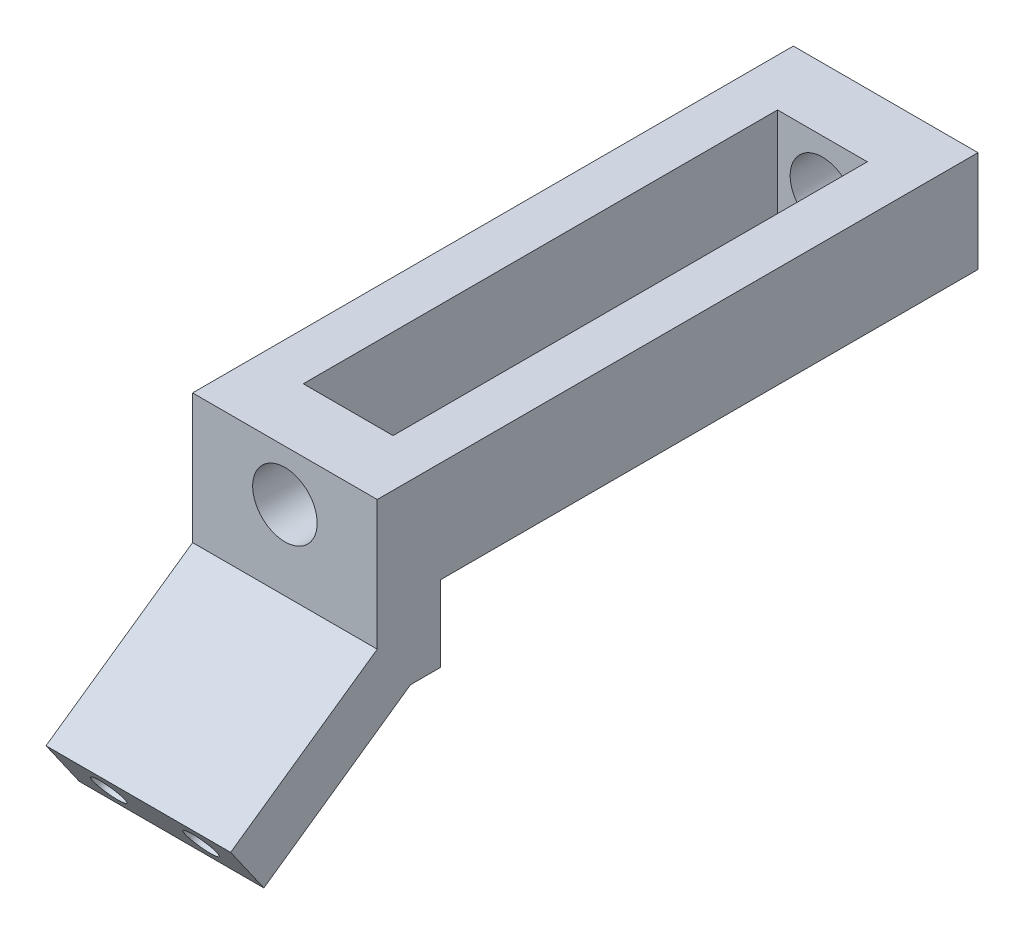
ISO-10303-21;
HEADER;
FILE_DESCRIPTION(('STEP AP214'),'2;1');
FILE_NAME('part.step','',(''),(''),'','','');
FILE_SCHEMA(('AUTOMOTIVE_DESIGN { 1 0 10303 214 1 1 1 1 }'));
ENDSEC;
DATA;
#1=APPLICATION_CONTEXT('core data for automotive mechanical design processes');
#2=APPLICATION_PROTOCOL_DEFINITION('international standard','automotive_design',2000,#1);
#3=PRODUCT_CONTEXT('',#1,'mechanical');
#4=PRODUCT('Part','Part','',(#3));
#5=PRODUCT_RELATED_PRODUCT_CATEGORY('part','',(#4));
#6=PRODUCT_DEFINITION_FORMATION('','',#4);
#7=PRODUCT_DEFINITION_CONTEXT('part definition',#1,'design');
#8=PRODUCT_DEFINITION('design','',#6,#7);
#9=PRODUCT_DEFINITION_SHAPE('','',#8);
#10=(LENGTH_UNIT() NAMED_UNIT(*) SI_UNIT(.MILLI.,.METRE.));
#11=(NAMED_UNIT(*) PLANE_ANGLE_UNIT() SI_UNIT($,.RADIAN.));
#12=(NAMED_UNIT(*) SI_UNIT($,.STERADIAN.) SOLID_ANGLE_UNIT());
#13=UNCERTAINTY_MEASURE_WITH_UNIT(LENGTH_MEASURE(1.E-05),#10,'distance_accuracy_value','');
#14=(GEOMETRIC_REPRESENTATION_CONTEXT(3) GLOBAL_UNCERTAINTY_ASSIGNED_CONTEXT((#13)) GLOBAL_UNIT_ASSIGNED_CONTEXT((#10,
#11,#12)) REPRESENTATION_CONTEXT('',''));
#15=CARTESIAN_POINT('',(0.,0.,0.));
#16=DIRECTION('',(0.,0.,1.));
#17=DIRECTION('',(1.,0.,0.));
#18=AXIS2_PLACEMENT_3D('',#15,#16,#17);
#19=CARTESIAN_POINT('',(-14.6,8.,10.));
#20=DIRECTION('',(1.,0.,0.));
#21=DIRECTION('',(0.,0.,-1.));
#22=AXIS2_PLACEMENT_3D('',#19,#20,#21);
#23=PLANE('',#22);
#24=DIRECTION('',(0.,0.,1.));
#25=VECTOR('',#24,1.);
#26=CARTESIAN_POINT('',(-14.6,-20.,85.));
#27=LINE('',#26,#25);
#28=CARTESIAN_POINT('',(-14.6,-20.,85.));
#29=VERTEX_POINT('',#28);
#30=CARTESIAN_POINT('',(-14.6,-20.,89.7484434634273));
#31=VERTEX_POINT('',#30);
#32=EDGE_CURVE('E162',#29,#31,#27,.T.);
#33=ORIENTED_EDGE('',*,*,#32,.T.);
#34=DIRECTION('',(0.,0.573576436351042,-0.819152044288995));
#35=VECTOR('',#34,1.);
#36=CARTESIAN_POINT('',(-14.6,-36.2322131487345,112.930446316806));
#37=LINE('',#36,#35);
#38=CARTESIAN_POINT('',(-14.6,-36.2322131487345,112.930446316806));
#39=VERTEX_POINT('',#38);
#40=EDGE_CURVE('E144',#39,#31,#37,.T.);
#41=ORIENTED_EDGE('',*,*,#40,.F.);
#42=DIRECTION('',(0.,-0.819152044288995,-0.573576436351042));
#43=VECTOR('',#42,1.);
#44=CARTESIAN_POINT('',(-14.6,-28.7322131487345,118.182002853379));
#45=LINE('',#44,#43);
#46=CARTESIAN_POINT('',(-14.6,-28.7322131487345,118.182002853379));
#47=VERTEX_POINT('',#46);
#48=EDGE_CURVE('E151',#47,#39,#45,.T.);
#49=ORIENTED_EDGE('',*,*,#48,.F.);
#50=DIRECTION('',(0.,0.573576436351042,-0.819152044288995));
#51=VECTOR('',#50,1.);
#52=CARTESIAN_POINT('',(-14.6,-28.7322131487345,118.182002853379));
#53=LINE('',#52,#51);
#54=CARTESIAN_POINT('',(-14.6,-12.5,95.));
#55=VERTEX_POINT('',#54);
#56=EDGE_CURVE('E289',#47,#55,#53,.T.);
#57=ORIENTED_EDGE('',*,*,#56,.T.);
#58=DIRECTION('',(0.,-1.,0.));
#59=VECTOR('',#58,1.);
#60=CARTESIAN_POINT('',(-14.6,8.,95.));
#61=LINE('',#60,#59);
#62=CARTESIAN_POINT('',(-14.6,8.,95.));
#63=VERTEX_POINT('',#62);
#64=EDGE_CURVE('E196',#63,#55,#61,.T.);
#65=ORIENTED_EDGE('',*,*,#64,.F.);
#66=DIRECTION('',(0.,0.,-1.));
#67=VECTOR('',#66,1.);
#68=CARTESIAN_POINT('',(-14.6,8.,10.));
#69=LINE('',#68,#67);
#70=CARTESIAN_POINT('',(-14.6,8.,0.));
#71=VERTEX_POINT('',#70);
#72=EDGE_CURVE('E244',#63,#71,#69,.T.);
#73=ORIENTED_EDGE('',*,*,#72,.T.);
#74=DIRECTION('',(0.,-1.,0.));
#75=VECTOR('',#74,1.);
#76=CARTESIAN_POINT('',(-14.6,8.,0.));
#77=LINE('',#76,#75);
#78=CARTESIAN_POINT('',(-14.6,-8.,0.));
#79=VERTEX_POINT('',#78);
#80=EDGE_CURVE('E219',#71,#79,#77,.T.);
#81=ORIENTED_EDGE('',*,*,#80,.T.);
#82=DIRECTION('',(0.,0.,-1.));
#83=VECTOR('',#82,1.);
#84=CARTESIAN_POINT('',(-14.6,-8.,10.));
#85=LINE('',#84,#83);
#86=CARTESIAN_POINT('',(-14.6,-8.,85.));
#87=VERTEX_POINT('',#86);
#88=EDGE_CURVE('E243',#87,#79,#85,.T.);
#89=ORIENTED_EDGE('',*,*,#88,.F.);
#90=DIRECTION('',(0.,-1.,0.));
#91=VECTOR('',#90,1.);
#92=CARTESIAN_POINT('',(-14.6,-8.,85.));
#93=LINE('',#92,#91);
#94=EDGE_CURVE('E59',#87,#29,#93,.T.);
#95=ORIENTED_EDGE('',*,*,#94,.T.);
#96=EDGE_LOOP('',(#33,#41,#49,#57,#65,#73,#81,#89,#95));
#97=FACE_BOUND('',#96,.T.);
#98=ADVANCED_FACE('F43',(#97),#23,.F.);
#99=CARTESIAN_POINT('',(14.6,-8.,10.));
#100=DIRECTION('',(-1.,0.,0.));
#101=DIRECTION('',(0.,0.,1.));
#102=AXIS2_PLACEMENT_3D('',#99,#100,#101);
#103=PLANE('',#102);
#104=DIRECTION('',(0.,1.,0.));
#105=VECTOR('',#104,1.);
#106=CARTESIAN_POINT('',(14.6,8.,95.));
#107=LINE('',#106,#105);
#108=CARTESIAN_POINT('',(14.6,-12.5,95.0000000000001));
#109=VERTEX_POINT('',#108);
#110=CARTESIAN_POINT('',(14.6,8.,95.));
#111=VERTEX_POINT('',#110);
#112=EDGE_CURVE('E212',#109,#111,#107,.T.);
#113=ORIENTED_EDGE('',*,*,#112,.F.);
#114=DIRECTION('',(0.,0.573576436351042,-0.819152044288995));
#115=VECTOR('',#114,1.);
#116=CARTESIAN_POINT('',(14.6,-28.7322131487345,118.182002853379));
#117=LINE('',#116,#115);
#118=CARTESIAN_POINT('',(14.6,-28.7322131487345,118.182002853379));
#119=VERTEX_POINT('',#118);
#120=EDGE_CURVE('E167',#119,#109,#117,.T.);
#121=ORIENTED_EDGE('',*,*,#120,.F.);
#122=DIRECTION('',(0.,0.819152044288995,0.573576436351042));
#123=VECTOR('',#122,1.);
#124=CARTESIAN_POINT('',(14.6,-28.7322131487345,118.182002853379));
#125=LINE('',#124,#123);
#126=CARTESIAN_POINT('',(14.6,-36.2322131487345,112.930446316806));
#127=VERTEX_POINT('',#126);
#128=EDGE_CURVE('E150',#127,#119,#125,.T.);
#129=ORIENTED_EDGE('',*,*,#128,.F.);
#130=DIRECTION('',(0.,0.573576436351042,-0.819152044288995));
#131=VECTOR('',#130,1.);
#132=CARTESIAN_POINT('',(14.6,-36.2322131487345,112.930446316806));
#133=LINE('',#132,#131);
#134=CARTESIAN_POINT('',(14.6,-20.,89.7484434634273));
#135=VERTEX_POINT('',#134);
#136=EDGE_CURVE('E147',#127,#135,#133,.T.);
#137=ORIENTED_EDGE('',*,*,#136,.T.);
#138=DIRECTION('',(0.,0.,1.));
#139=VECTOR('',#138,1.);
#140=CARTESIAN_POINT('',(14.6,-20.,85.));
#141=LINE('',#140,#139);
#142=CARTESIAN_POINT('',(14.6,-20.,85.));
#143=VERTEX_POINT('',#142);
#144=EDGE_CURVE('E179',#143,#135,#141,.T.);
#145=ORIENTED_EDGE('',*,*,#144,.F.);
#146=DIRECTION('',(0.,1.,0.));
#147=VECTOR('',#146,1.);
#148=CARTESIAN_POINT('',(14.6,-8.,85.));
#149=LINE('',#148,#147);
#150=CARTESIAN_POINT('',(14.6,-8.,85.));
#151=VERTEX_POINT('',#150);
#152=EDGE_CURVE('E177',#143,#151,#149,.T.);
#153=ORIENTED_EDGE('',*,*,#152,.T.);
#154=DIRECTION('',(0.,0.,-1.));
#155=VECTOR('',#154,1.);
#156=CARTESIAN_POINT('',(14.6,-8.,10.));
#157=LINE('',#156,#155);
#158=CARTESIAN_POINT('',(14.6,-8.,0.));
#159=VERTEX_POINT('',#158);
#160=EDGE_CURVE('E241',#151,#159,#157,.T.);
#161=ORIENTED_EDGE('',*,*,#160,.T.);
#162=DIRECTION('',(0.,1.,0.));
#163=VECTOR('',#162,1.);
#164=CARTESIAN_POINT('',(14.6,-8.,0.));
#165=LINE('',#164,#163);
#166=CARTESIAN_POINT('',(14.6,8.,0.));
#167=VERTEX_POINT('',#166);
#168=EDGE_CURVE('E235',#159,#167,#165,.T.);
#169=ORIENTED_EDGE('',*,*,#168,.T.);
#170=DIRECTION('',(0.,0.,-1.));
#171=VECTOR('',#170,1.);
#172=CARTESIAN_POINT('',(14.6,8.,10.));
#173=LINE('',#172,#171);
#174=EDGE_CURVE('E229',#111,#167,#173,.T.);
#175=ORIENTED_EDGE('',*,*,#174,.F.);
#176=EDGE_LOOP('',(#113,#121,#129,#137,#145,#153,#161,#169,#175));
#177=FACE_BOUND('',#176,.T.);
#178=ADVANCED_FACE('F273',(#177),#103,.F.);
#179=CARTESIAN_POINT('',(0.,0.,95.));
#180=DIRECTION('',(0.,0.,1.));
#181=DIRECTION('',(1.,0.,0.));
#182=AXIS2_PLACEMENT_3D('',#179,#180,#181);
#183=PLANE('',#182);
#184=CARTESIAN_POINT('',(0.,0.,95.));
#185=DIRECTION('',(0.,0.,1.));
#186=DIRECTION('',(1.,0.,0.));
#187=AXIS2_PLACEMENT_3D('',#184,#185,#186);
#188=CIRCLE('',#187,5.1);
#189=CARTESIAN_POINT('',(5.1,0.,95.));
#190=VERTEX_POINT('',#189);
#191=EDGE_CURVE('E182',#190,#190,#188,.T.);
#192=ORIENTED_EDGE('',*,*,#191,.F.);
#193=EDGE_LOOP('',(#192));
#194=FACE_BOUND('',#193,.T.);
#195=ORIENTED_EDGE('',*,*,#64,.T.);
#196=DIRECTION('',(1.,0.,0.));
#197=VECTOR('',#196,1.);
#198=CARTESIAN_POINT('',(-14.601,-12.5,95.));
#199=LINE('',#198,#197);
#200=EDGE_CURVE('E165',#55,#109,#199,.T.);
#201=ORIENTED_EDGE('',*,*,#200,.T.);
#202=ORIENTED_EDGE('',*,*,#112,.T.);
#203=DIRECTION('',(-1.,0.,0.));
#204=VECTOR('',#203,1.);
#205=CARTESIAN_POINT('',(-14.6,8.,95.));
#206=LINE('',#205,#204);
#207=EDGE_CURVE('E199',#111,#63,#206,.T.);
#208=ORIENTED_EDGE('',*,*,#207,.T.);
#209=EDGE_LOOP('',(#195,#201,#202,#208));
#210=FACE_BOUND('',#209,.T.);
#211=ADVANCED_FACE('F285',(#194,#210),#183,.T.);
#212=CARTESIAN_POINT('',(-14.6,-20.,85.));
#213=DIRECTION('',(0.,-1.,0.));
#214=DIRECTION('',(0.,0.,-1.));
#215=AXIS2_PLACEMENT_3D('',#212,#213,#214);
#216=PLANE('',#215);
#217=ORIENTED_EDGE('',*,*,#144,.T.);
#218=DIRECTION('',(1.,0.,0.));
#219=VECTOR('',#218,1.);
#220=CARTESIAN_POINT('',(-14.601,-20.,89.7484434634273));
#221=LINE('',#220,#219);
#222=EDGE_CURVE('E163',#31,#135,#221,.T.);
#223=ORIENTED_EDGE('',*,*,#222,.F.);
#224=ORIENTED_EDGE('',*,*,#32,.F.);
#225=DIRECTION('',(1.,0.,0.));
#226=VECTOR('',#225,1.);
#227=CARTESIAN_POINT('',(-14.6,-20.,85.));
#228=LINE('',#227,#226);
#229=EDGE_CURVE('E174',#29,#143,#228,.T.);
#230=ORIENTED_EDGE('',*,*,#229,.T.);
#231=EDGE_LOOP('',(#217,#223,#224,#230));
#232=FACE_BOUND('',#231,.T.);
#233=ADVANCED_FACE('F277',(#232),#216,.T.);
#234=CARTESIAN_POINT('',(0.,0.,10.));
#235=DIRECTION('',(0.,0.,1.));
#236=DIRECTION('',(1.,0.,0.));
#237=AXIS2_PLACEMENT_3D('',#234,#235,#236);
#238=PLANE('',#237);
#239=DIRECTION('',(0.,1.,0.));
#240=VECTOR('',#239,1.);
#241=CARTESIAN_POINT('',(-7.1,8.,10.));
#242=LINE('',#241,#240);
#243=CARTESIAN_POINT('',(-7.1,-8.,10.));
#244=VERTEX_POINT('',#243);
#245=CARTESIAN_POINT('',(-7.1,8.,10.));
#246=VERTEX_POINT('',#245);
#247=EDGE_CURVE('E200',#244,#246,#242,.T.);
#248=ORIENTED_EDGE('',*,*,#247,.F.);
#249=DIRECTION('',(1.,0.,0.));
#250=VECTOR('',#249,1.);
#251=CARTESIAN_POINT('',(-14.6,-8.,10.));
#252=LINE('',#251,#250);
#253=CARTESIAN_POINT('',(7.1,-8.,10.));
#254=VERTEX_POINT('',#253);
#255=EDGE_CURVE('E225',#244,#254,#252,.T.);
#256=ORIENTED_EDGE('',*,*,#255,.T.);
#257=DIRECTION('',(0.,-1.,0.));
#258=VECTOR('',#257,1.);
#259=CARTESIAN_POINT('',(7.1,8.,10.));
#260=LINE('',#259,#258);
#261=CARTESIAN_POINT('',(7.1,8.,10.));
#262=VERTEX_POINT('',#261);
#263=EDGE_CURVE('E205',#262,#254,#260,.T.);
#264=ORIENTED_EDGE('',*,*,#263,.F.);
#265=DIRECTION('',(-1.,0.,0.));
#266=VECTOR('',#265,1.);
#267=CARTESIAN_POINT('',(-7.1,8.,10.));
#268=LINE('',#267,#266);
#269=EDGE_CURVE('E222',#262,#246,#268,.T.);
#270=ORIENTED_EDGE('',*,*,#269,.T.);
#271=EDGE_LOOP('',(#248,#256,#264,#270));
#272=FACE_BOUND('',#271,.T.);
#273=CARTESIAN_POINT('',(0.,0.,10.));
#274=DIRECTION('',(0.,0.,1.));
#275=DIRECTION('',(1.,0.,0.));
#276=AXIS2_PLACEMENT_3D('',#273,#274,#275);
#277=CIRCLE('',#276,5.1);
#278=CARTESIAN_POINT('',(5.1,0.,10.));
#279=VERTEX_POINT('',#278);
#280=EDGE_CURVE('E216',#279,#279,#277,.T.);
#281=ORIENTED_EDGE('',*,*,#280,.F.);
#282=EDGE_LOOP('',(#281));
#283=FACE_BOUND('',#282,.T.);
#284=ADVANCED_FACE('F256',(#272,#283),#238,.T.);
#285=CARTESIAN_POINT('',(0.,0.,0.));
#286=DIRECTION('',(0.,0.,1.));
#287=DIRECTION('',(1.,0.,0.));
#288=AXIS2_PLACEMENT_3D('',#285,#286,#287);
#289=PLANE('',#288);
#290=ORIENTED_EDGE('',*,*,#80,.F.);
#291=DIRECTION('',(-1.,0.,0.));
#292=VECTOR('',#291,1.);
#293=CARTESIAN_POINT('',(14.6,8.,0.));
#294=LINE('',#293,#292);
#295=EDGE_CURVE('E226',#167,#71,#294,.T.);
#296=ORIENTED_EDGE('',*,*,#295,.F.);
#297=ORIENTED_EDGE('',*,*,#168,.F.);
#298=DIRECTION('',(1.,0.,0.));
#299=VECTOR('',#298,1.);
#300=CARTESIAN_POINT('',(7.1,-8.,0.));
#301=LINE('',#300,#299);
#302=EDGE_CURVE('E232',#79,#159,#301,.T.);
#303=ORIENTED_EDGE('',*,*,#302,.F.);
#304=EDGE_LOOP('',(#290,#296,#297,#303));
#305=FACE_BOUND('',#304,.T.);
#306=CARTESIAN_POINT('',(0.,0.,0.));
#307=DIRECTION('',(0.,0.,1.));
#308=DIRECTION('',(1.,0.,0.));
#309=AXIS2_PLACEMENT_3D('',#306,#307,#308);
#310=CIRCLE('',#309,5.1);
#311=CARTESIAN_POINT('',(5.1,0.,0.));
#312=VERTEX_POINT('',#311);
#313=EDGE_CURVE('E208',#312,#312,#310,.T.);
#314=ORIENTED_EDGE('',*,*,#313,.T.);
#315=EDGE_LOOP('',(#314));
#316=FACE_BOUND('',#315,.T.);
#317=ADVANCED_FACE('F280',(#305,#316),#289,.F.);
#318=CARTESIAN_POINT('',(7.1,-8.,10.));
#319=DIRECTION('',(0.,1.,0.));
#320=DIRECTION('',(0.,0.,1.));
#321=AXIS2_PLACEMENT_3D('',#318,#319,#320);
#322=PLANE('',#321);
#323=ORIENTED_EDGE('',*,*,#160,.F.);
#324=DIRECTION('',(-1.,0.,0.));
#325=VECTOR('',#324,1.);
#326=CARTESIAN_POINT('',(-14.6,-8.,85.));
#327=LINE('',#326,#325);
#328=CARTESIAN_POINT('',(7.1,-8.,85.));
#329=VERTEX_POINT('',#328);
#330=EDGE_CURVE('E52',#151,#329,#327,.T.);
#331=ORIENTED_EDGE('',*,*,#330,.T.);
#332=DIRECTION('',(0.,0.,-1.));
#333=VECTOR('',#332,1.);
#334=CARTESIAN_POINT('',(7.1,-8.,95.));
#335=LINE('',#334,#333);
#336=EDGE_CURVE('E210',#329,#254,#335,.T.);
#337=ORIENTED_EDGE('',*,*,#336,.T.);
#338=ORIENTED_EDGE('',*,*,#255,.F.);
#339=DIRECTION('',(0.,0.,-1.));
#340=VECTOR('',#339,1.);
#341=CARTESIAN_POINT('',(-7.1,-8.,95.));
#342=LINE('',#341,#340);
#343=CARTESIAN_POINT('',(-7.1,-8.,85.));
#344=VERTEX_POINT('',#343);
#345=EDGE_CURVE('E66',#344,#244,#342,.T.);
#346=ORIENTED_EDGE('',*,*,#345,.F.);
#347=EDGE_CURVE('E11',#344,#87,#327,.T.);
#348=ORIENTED_EDGE('',*,*,#347,.T.);
#349=ORIENTED_EDGE('',*,*,#88,.T.);
#350=ORIENTED_EDGE('',*,*,#302,.T.);
#351=EDGE_LOOP('',(#323,#331,#337,#338,#346,#348,#349,#350));
#352=FACE_BOUND('',#351,.T.);
#353=ADVANCED_FACE('F251',(#352),#322,.F.);
#354=CARTESIAN_POINT('',(14.6,8.,10.));
#355=DIRECTION('',(0.,-1.,0.));
#356=DIRECTION('',(1.,0.,0.));
#357=AXIS2_PLACEMENT_3D('',#354,#355,#356);
#358=PLANE('',#357);
#359=DIRECTION('',(-1.,0.,0.));
#360=VECTOR('',#359,1.);
#361=CARTESIAN_POINT('',(-14.6,8.,85.));
#362=LINE('',#361,#360);
#363=CARTESIAN_POINT('',(7.1,8.,85.));
#364=VERTEX_POINT('',#363);
#365=CARTESIAN_POINT('',(-7.1,8.,85.));
#366=VERTEX_POINT('',#365);
#367=EDGE_CURVE('E187',#364,#366,#362,.T.);
#368=ORIENTED_EDGE('',*,*,#367,.T.);
#369=DIRECTION('',(0.,0.,-1.));
#370=VECTOR('',#369,1.);
#371=CARTESIAN_POINT('',(-7.1,8.,95.));
#372=LINE('',#371,#370);
#373=EDGE_CURVE('E203',#366,#246,#372,.T.);
#374=ORIENTED_EDGE('',*,*,#373,.T.);
#375=ORIENTED_EDGE('',*,*,#269,.F.);
#376=DIRECTION('',(0.,0.,-1.));
#377=VECTOR('',#376,1.);
#378=CARTESIAN_POINT('',(7.1,8.,95.));
#379=LINE('',#378,#377);
#380=EDGE_CURVE('E195',#364,#262,#379,.T.);
#381=ORIENTED_EDGE('',*,*,#380,.F.);
#382=EDGE_LOOP('',(#368,#374,#375,#381));
#383=FACE_BOUND('',#382,.T.);
#384=ORIENTED_EDGE('',*,*,#295,.T.);
#385=ORIENTED_EDGE('',*,*,#72,.F.);
#386=ORIENTED_EDGE('',*,*,#207,.F.);
#387=ORIENTED_EDGE('',*,*,#174,.T.);
#388=EDGE_LOOP('',(#384,#385,#386,#387));
#389=FACE_BOUND('',#388,.T.);
#390=ADVANCED_FACE('F264',(#383,#389),#358,.F.);
#391=CARTESIAN_POINT('',(0.,0.,10.));
#392=DIRECTION('',(0.,0.,-1.));
#393=DIRECTION('',(-1.,0.,0.));
#394=AXIS2_PLACEMENT_3D('',#391,#392,#393);
#395=CYLINDRICAL_SURFACE('',#394,5.1);
#396=ORIENTED_EDGE('',*,*,#280,.T.);
#397=EDGE_LOOP('',(#396));
#398=FACE_BOUND('',#397,.T.);
#399=ORIENTED_EDGE('',*,*,#313,.F.);
#400=EDGE_LOOP('',(#399));
#401=FACE_BOUND('',#400,.T.);
#402=ADVANCED_FACE('F349',(#398,#401),#395,.F.);
#403=CARTESIAN_POINT('',(7.1,8.,95.));
#404=DIRECTION('',(1.,0.,0.));
#405=DIRECTION('',(0.,1.,0.));
#406=AXIS2_PLACEMENT_3D('',#403,#404,#405);
#407=PLANE('',#406);
#408=ORIENTED_EDGE('',*,*,#336,.F.);
#409=DIRECTION('',(0.,1.,0.));
#410=VECTOR('',#409,1.);
#411=CARTESIAN_POINT('',(7.1,8.,85.));
#412=LINE('',#411,#410);
#413=EDGE_CURVE('E192',#329,#364,#412,.T.);
#414=ORIENTED_EDGE('',*,*,#413,.T.);
#415=ORIENTED_EDGE('',*,*,#380,.T.);
#416=ORIENTED_EDGE('',*,*,#263,.T.);
#417=EDGE_LOOP('',(#408,#414,#415,#416));
#418=FACE_BOUND('',#417,.T.);
#419=ADVANCED_FACE('F260',(#418),#407,.F.);
#420=CARTESIAN_POINT('',(-7.1,8.,95.));
#421=DIRECTION('',(-1.,0.,0.));
#422=DIRECTION('',(0.,-1.,0.));
#423=AXIS2_PLACEMENT_3D('',#420,#421,#422);
#424=PLANE('',#423);
#425=ORIENTED_EDGE('',*,*,#373,.F.);
#426=DIRECTION('',(0.,-1.,0.));
#427=VECTOR('',#426,1.);
#428=CARTESIAN_POINT('',(-7.1,8.,85.));
#429=LINE('',#428,#427);
#430=EDGE_CURVE('E46',#366,#344,#429,.T.);
#431=ORIENTED_EDGE('',*,*,#430,.T.);
#432=ORIENTED_EDGE('',*,*,#345,.T.);
#433=ORIENTED_EDGE('',*,*,#247,.T.);
#434=EDGE_LOOP('',(#425,#431,#432,#433));
#435=FACE_BOUND('',#434,.T.);
#436=ADVANCED_FACE('F247',(#435),#424,.F.);
#437=CARTESIAN_POINT('',(0.,0.,85.));
#438=DIRECTION('',(0.,0.,-1.));
#439=DIRECTION('',(-1.,0.,0.));
#440=AXIS2_PLACEMENT_3D('',#437,#438,#439);
#441=PLANE('',#440);
#442=CARTESIAN_POINT('',(0.,0.,85.));
#443=DIRECTION('',(0.,0.,1.));
#444=DIRECTION('',(1.,0.,0.));
#445=AXIS2_PLACEMENT_3D('',#442,#443,#444);
#446=CIRCLE('',#445,5.1);
#447=CARTESIAN_POINT('',(5.1,0.,85.));
#448=VERTEX_POINT('',#447);
#449=EDGE_CURVE('E184',#448,#448,#446,.T.);
#450=ORIENTED_EDGE('',*,*,#449,.T.);
#451=EDGE_LOOP('',(#450));
#452=FACE_BOUND('',#451,.T.);
#453=ORIENTED_EDGE('',*,*,#413,.F.);
#454=ORIENTED_EDGE('',*,*,#330,.F.);
#455=ORIENTED_EDGE('',*,*,#152,.F.);
#456=ORIENTED_EDGE('',*,*,#229,.F.);
#457=ORIENTED_EDGE('',*,*,#94,.F.);
#458=ORIENTED_EDGE('',*,*,#347,.F.);
#459=ORIENTED_EDGE('',*,*,#430,.F.);
#460=ORIENTED_EDGE('',*,*,#367,.F.);
#461=EDGE_LOOP('',(#453,#454,#455,#456,#457,#458,#459,#460));
#462=FACE_BOUND('',#461,.T.);
#463=ADVANCED_FACE('F266',(#452,#462),#441,.T.);
#464=CARTESIAN_POINT('',(0.,0.,85.));
#465=DIRECTION('',(0.,0.,1.));
#466=DIRECTION('',(1.,0.,0.));
#467=AXIS2_PLACEMENT_3D('',#464,#465,#466);
#468=CYLINDRICAL_SURFACE('',#467,5.1);
#469=ORIENTED_EDGE('',*,*,#449,.F.);
#470=EDGE_LOOP('',(#469));
#471=FACE_BOUND('',#470,.T.);
#472=ORIENTED_EDGE('',*,*,#191,.T.);
#473=EDGE_LOOP('',(#472));
#474=FACE_BOUND('',#473,.T.);
#475=ADVANCED_FACE('F363',(#471,#474),#468,.F.);
#476=CARTESIAN_POINT('',(-14.6,-36.2322131487345,112.930446316806));
#477=DIRECTION('',(0.,0.819152044288995,0.573576436351042));
#478=DIRECTION('',(0.,-0.573576436351042,0.819152044288995));
#479=AXIS2_PLACEMENT_3D('',#476,#477,#478);
#480=PLANE('',#479);
#481=ORIENTED_EDGE('',*,*,#222,.T.);
#482=ORIENTED_EDGE('',*,*,#136,.F.);
#483=DIRECTION('',(1.,0.,0.));
#484=VECTOR('',#483,1.);
#485=CARTESIAN_POINT('',(-14.6,-36.2322131487345,112.930446316806));
#486=LINE('',#485,#484);
#487=EDGE_CURVE('E140',#39,#127,#486,.T.);
#488=ORIENTED_EDGE('',*,*,#487,.F.);
#489=ORIENTED_EDGE('',*,*,#40,.T.);
#490=EDGE_LOOP('',(#481,#482,#488,#489));
#491=FACE_BOUND('',#490,.T.);
#492=ADVANCED_FACE('F142',(#491),#480,.F.);
#493=CARTESIAN_POINT('',(-14.6,-28.7322131487345,118.182002853379));
#494=DIRECTION('',(0.,-0.819152044288995,-0.573576436351042));
#495=DIRECTION('',(0.,0.573576436351042,-0.819152044288995));
#496=AXIS2_PLACEMENT_3D('',#493,#494,#495);
#497=PLANE('',#496);
#498=ORIENTED_EDGE('',*,*,#200,.F.);
#499=ORIENTED_EDGE('',*,*,#56,.F.);
#500=DIRECTION('',(-1.,0.,0.));
#501=VECTOR('',#500,1.);
#502=CARTESIAN_POINT('',(-14.6,-28.7322131487345,118.182002853379));
#503=LINE('',#502,#501);
#504=EDGE_CURVE('E156',#119,#47,#503,.T.);
#505=ORIENTED_EDGE('',*,*,#504,.F.);
#506=ORIENTED_EDGE('',*,*,#120,.T.);
#507=EDGE_LOOP('',(#498,#499,#505,#506));
#508=FACE_BOUND('',#507,.T.);
#509=ADVANCED_FACE('F288',(#508),#497,.F.);
#510=CARTESIAN_POINT('',(0.,-64.9799867402795,92.8010385412602));
#511=DIRECTION('',(0.,-0.573576436351042,0.819152044288995));
#512=DIRECTION('',(0.,-0.819152044288995,-0.573576436351042));
#513=AXIS2_PLACEMENT_3D('',#510,#511,#512);
#514=PLANE('',#513);
#515=CARTESIAN_POINT('',(-7.3,-32.4822131487345,115.556224585092));
#516=DIRECTION('',(0.,-0.573576436351041,0.819152044288995));
#517=DIRECTION('',(0.,-0.819152044288995,-0.573576436351041));
#518=AXIS2_PLACEMENT_3D('',#515,#516,#517);
#519=CIRCLE('',#518,2.5);
#520=CARTESIAN_POINT('',(-7.3,-34.530093259457,114.122283494215));
#521=VERTEX_POINT('',#520);
#522=EDGE_CURVE('E300',#521,#521,#519,.T.);
#523=ORIENTED_EDGE('',*,*,#522,.F.);
#524=EDGE_LOOP('',(#523));
#525=FACE_BOUND('',#524,.T.);
#526=CARTESIAN_POINT('',(7.3,-32.4822131487345,115.556224585092));
#527=DIRECTION('',(0.,-0.573576436351041,0.819152044288995));
#528=DIRECTION('',(0.,-0.819152044288995,-0.573576436351041));
#529=AXIS2_PLACEMENT_3D('',#526,#527,#528);
#530=CIRCLE('',#529,2.5);
#531=CARTESIAN_POINT('',(7.3,-34.530093259457,114.122283494215));
#532=VERTEX_POINT('',#531);
#533=EDGE_CURVE('E297',#532,#532,#530,.T.);
#534=ORIENTED_EDGE('',*,*,#533,.F.);
#535=EDGE_LOOP('',(#534));
#536=FACE_BOUND('',#535,.T.);
#537=ORIENTED_EDGE('',*,*,#48,.T.);
#538=ORIENTED_EDGE('',*,*,#487,.T.);
#539=ORIENTED_EDGE('',*,*,#128,.T.);
#540=ORIENTED_EDGE('',*,*,#504,.T.);
#541=EDGE_LOOP('',(#537,#538,#539,#540));
#542=FACE_BOUND('',#541,.T.);
#543=ADVANCED_FACE('F154',(#525,#536,#542),#514,.T.);
#544=CARTESIAN_POINT('',(7.3,-21.0106844217137,99.1731836993124));
#545=DIRECTION('',(0.,-0.573576436351041,0.819152044288995));
#546=DIRECTION('',(0.,-0.819152044288995,-0.573576436351041));
#547=AXIS2_PLACEMENT_3D('',#544,#545,#546);
#548=CYLINDRICAL_SURFACE('',#547,2.5);
#549=CARTESIAN_POINT('',(7.3,-21.0106844217137,99.1731836993124));
#550=DIRECTION('',(0.,-0.573576436351041,0.819152044288995));
#551=DIRECTION('',(0.,-0.819152044288995,-0.573576436351041));
#552=AXIS2_PLACEMENT_3D('',#549,#550,#551);
#553=CIRCLE('',#552,2.5);
#554=CARTESIAN_POINT('',(7.3,-23.0585645324362,97.7392426084348));
#555=VERTEX_POINT('',#554);
#556=EDGE_CURVE('E294',#555,#555,#553,.T.);
#557=ORIENTED_EDGE('',*,*,#556,.F.);
#558=EDGE_LOOP('',(#557));
#559=FACE_BOUND('',#558,.T.);
#560=ORIENTED_EDGE('',*,*,#533,.T.);
#561=EDGE_LOOP('',(#560));
#562=FACE_BOUND('',#561,.T.);
#563=ADVANCED_FACE('F317',(#559,#562),#548,.F.);
#564=CARTESIAN_POINT('',(7.3,-21.0106844217137,99.1731836993124));
#565=DIRECTION('',(0.,-0.573576436351041,0.819152044288995));
#566=DIRECTION('',(0.,-0.819152044288995,-0.573576436351041));
#567=AXIS2_PLACEMENT_3D('',#564,#565,#566);
#568=PLANE('',#567);
#569=ORIENTED_EDGE('',*,*,#556,.T.);
#570=EDGE_LOOP('',(#569));
#571=FACE_BOUND('',#570,.T.);
#572=ADVANCED_FACE('F311',(#571),#568,.T.);
#573=CARTESIAN_POINT('',(-7.3,-21.0106844217137,99.1731836993124));
#574=DIRECTION('',(0.,-0.573576436351041,0.819152044288995));
#575=DIRECTION('',(0.,-0.819152044288995,-0.573576436351041));
#576=AXIS2_PLACEMENT_3D('',#573,#574,#575);
#577=CYLINDRICAL_SURFACE('',#576,2.5);
#578=CARTESIAN_POINT('',(-7.3,-21.0106844217137,99.1731836993124));
#579=DIRECTION('',(0.,-0.573576436351041,0.819152044288995));
#580=DIRECTION('',(0.,-0.819152044288995,-0.573576436351041));
#581=AXIS2_PLACEMENT_3D('',#578,#579,#580);
#582=CIRCLE('',#581,2.5);
#583=CARTESIAN_POINT('',(-7.3,-23.0585645324362,97.7392426084348));
#584=VERTEX_POINT('',#583);
#585=EDGE_CURVE('E159',#584,#584,#582,.T.);
#586=ORIENTED_EDGE('',*,*,#585,.F.);
#587=EDGE_LOOP('',(#586));
#588=FACE_BOUND('',#587,.T.);
#589=ORIENTED_EDGE('',*,*,#522,.T.);
#590=EDGE_LOOP('',(#589));
#591=FACE_BOUND('',#590,.T.);
#592=ADVANCED_FACE('F308',(#588,#591),#577,.F.);
#593=CARTESIAN_POINT('',(-7.3,-21.0106844217137,99.1731836993124));
#594=DIRECTION('',(0.,-0.573576436351041,0.819152044288995));
#595=DIRECTION('',(0.,-0.819152044288995,-0.573576436351041));
#596=AXIS2_PLACEMENT_3D('',#593,#594,#595);
#597=PLANE('',#596);
#598=ORIENTED_EDGE('',*,*,#585,.T.);
#599=EDGE_LOOP('',(#598));
#600=FACE_BOUND('',#599,.T.);
#601=ADVANCED_FACE('F306',(#600),#597,.T.);
#602=CLOSED_SHELL('',(#98,#178,#211,#233,#284,#317,#353,#390,#402,#419,#436,#463,#475,#492,#509,
#543,#563,#572,#592,#601));
#603=MANIFOLD_SOLID_BREP('B2',#602);
#604=ADVANCED_BREP_SHAPE_REPRESENTATION('',(#18,#603),#14);
#605=SHAPE_DEFINITION_REPRESENTATION(#9,#604);
ENDSEC;
END-ISO-10303-21;
